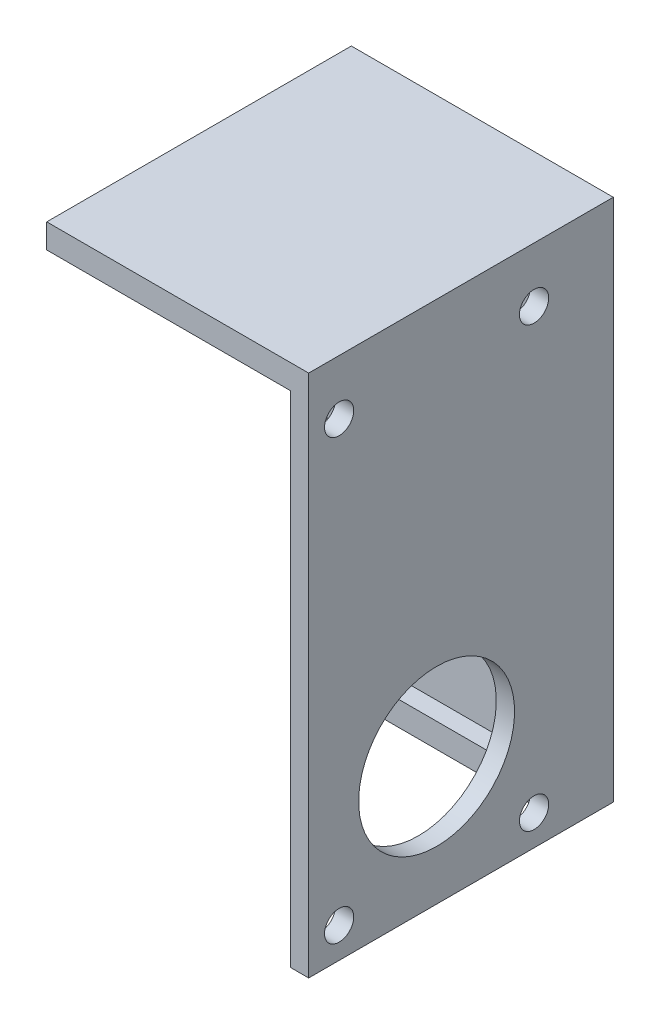
ISO-10303-21;
HEADER;
FILE_DESCRIPTION(('STEP AP214'),'2;1');
FILE_NAME('part.step','',(''),(''),'','','');
FILE_SCHEMA(('AUTOMOTIVE_DESIGN { 1 0 10303 214 1 1 1 1 }'));
ENDSEC;
DATA;
#1=APPLICATION_CONTEXT('core data for automotive mechanical design processes');
#2=APPLICATION_PROTOCOL_DEFINITION('international standard','automotive_design',2000,#1);
#3=PRODUCT_CONTEXT('',#1,'mechanical');
#4=PRODUCT('Part','Part','',(#3));
#5=PRODUCT_RELATED_PRODUCT_CATEGORY('part','',(#4));
#6=PRODUCT_DEFINITION_FORMATION('','',#4);
#7=PRODUCT_DEFINITION_CONTEXT('part definition',#1,'design');
#8=PRODUCT_DEFINITION('design','',#6,#7);
#9=PRODUCT_DEFINITION_SHAPE('','',#8);
#10=(LENGTH_UNIT() NAMED_UNIT(*) SI_UNIT(.MILLI.,.METRE.));
#11=(NAMED_UNIT(*) PLANE_ANGLE_UNIT() SI_UNIT($,.RADIAN.));
#12=(NAMED_UNIT(*) SI_UNIT($,.STERADIAN.) SOLID_ANGLE_UNIT());
#13=UNCERTAINTY_MEASURE_WITH_UNIT(LENGTH_MEASURE(1.E-05),#10,'distance_accuracy_value','');
#14=(GEOMETRIC_REPRESENTATION_CONTEXT(3) GLOBAL_UNCERTAINTY_ASSIGNED_CONTEXT((#13)) GLOBAL_UNIT_ASSIGNED_CONTEXT((#10,
#11,#12)) REPRESENTATION_CONTEXT('',''));
#15=CARTESIAN_POINT('',(0.,0.,0.));
#16=DIRECTION('',(0.,0.,1.));
#17=DIRECTION('',(1.,0.,0.));
#18=AXIS2_PLACEMENT_3D('',#15,#16,#17);
#19=CARTESIAN_POINT('',(10.,0.,25.));
#20=DIRECTION('',(1.,0.,0.));
#21=DIRECTION('',(0.,1.,0.));
#22=AXIS2_PLACEMENT_3D('',#19,#20,#21);
#23=PLANE('',#22);
#24=CARTESIAN_POINT('',(10.,-18.,6.50000000000001));
#25=DIRECTION('',(1.,0.,0.));
#26=DIRECTION('',(0.,1.,0.));
#27=AXIS2_PLACEMENT_3D('',#24,#25,#26);
#28=CIRCLE('',#27,1.2);
#29=CARTESIAN_POINT('',(10.,-16.8,6.50000000000001));
#30=VERTEX_POINT('',#29);
#31=EDGE_CURVE('E193',#30,#30,#28,.F.);
#32=ORIENTED_EDGE('',*,*,#31,.F.);
#33=EDGE_LOOP('',(#32));
#34=FACE_BOUND('',#33,.T.);
#35=CARTESIAN_POINT('',(10.,18.,22.5));
#36=DIRECTION('',(1.,0.,0.));
#37=DIRECTION('',(0.,1.,0.));
#38=AXIS2_PLACEMENT_3D('',#35,#36,#37);
#39=CIRCLE('',#38,1.2);
#40=CARTESIAN_POINT('',(10.,19.2,22.5));
#41=VERTEX_POINT('',#40);
#42=EDGE_CURVE('E189',#41,#41,#39,.F.);
#43=ORIENTED_EDGE('',*,*,#42,.F.);
#44=EDGE_LOOP('',(#43));
#45=FACE_BOUND('',#44,.T.);
#46=CARTESIAN_POINT('',(10.,-18.,22.5));
#47=DIRECTION('',(1.,0.,0.));
#48=DIRECTION('',(0.,1.,0.));
#49=AXIS2_PLACEMENT_3D('',#46,#47,#48);
#50=CIRCLE('',#49,1.2);
#51=CARTESIAN_POINT('',(10.,-16.8,22.5));
#52=VERTEX_POINT('',#51);
#53=EDGE_CURVE('E177',#52,#52,#50,.T.);
#54=ORIENTED_EDGE('',*,*,#53,.T.);
#55=EDGE_LOOP('',(#54));
#56=FACE_BOUND('',#55,.T.);
#57=CARTESIAN_POINT('',(10.,-10.,14.5));
#58=DIRECTION('',(1.,0.,0.));
#59=DIRECTION('',(0.,1.,0.));
#60=AXIS2_PLACEMENT_3D('',#57,#58,#59);
#61=CIRCLE('',#60,6.4);
#62=CARTESIAN_POINT('',(10.,-3.60000000000001,14.5));
#63=VERTEX_POINT('',#62);
#64=EDGE_CURVE('E181',#63,#63,#61,.T.);
#65=ORIENTED_EDGE('',*,*,#64,.T.);
#66=EDGE_LOOP('',(#65));
#67=FACE_BOUND('',#66,.T.);
#68=CARTESIAN_POINT('',(10.,18.,6.50000000000001));
#69=DIRECTION('',(1.,0.,0.));
#70=DIRECTION('',(0.,1.,0.));
#71=AXIS2_PLACEMENT_3D('',#68,#69,#70);
#72=CIRCLE('',#71,1.2);
#73=CARTESIAN_POINT('',(10.,19.2,6.50000000000001));
#74=VERTEX_POINT('',#73);
#75=EDGE_CURVE('E185',#74,#74,#72,.T.);
#76=ORIENTED_EDGE('',*,*,#75,.T.);
#77=EDGE_LOOP('',(#76));
#78=FACE_BOUND('',#77,.T.);
#79=DIRECTION('',(0.,-1.,0.));
#80=VECTOR('',#79,1.);
#81=CARTESIAN_POINT('',(10.,20.5,3.5));
#82=LINE('',#81,#80);
#83=CARTESIAN_POINT('',(10.,20.5,3.5));
#84=VERTEX_POINT('',#83);
#85=CARTESIAN_POINT('',(10.,18.5,3.5));
#86=VERTEX_POINT('',#85);
#87=EDGE_CURVE('E57',#84,#86,#82,.T.);
#88=ORIENTED_EDGE('',*,*,#87,.T.);
#89=DIRECTION('',(0.,0.,-1.));
#90=VECTOR('',#89,1.);
#91=CARTESIAN_POINT('',(10.,18.5,3.5));
#92=LINE('',#91,#90);
#93=CARTESIAN_POINT('',(10.,18.5,2.));
#94=VERTEX_POINT('',#93);
#95=EDGE_CURVE('E355',#86,#94,#92,.T.);
#96=ORIENTED_EDGE('',*,*,#95,.T.);
#97=DIRECTION('',(0.,-1.,0.));
#98=VECTOR('',#97,1.);
#99=CARTESIAN_POINT('',(10.,0.,2.));
#100=LINE('',#99,#98);
#101=CARTESIAN_POINT('',(10.,-18.5,2.));
#102=VERTEX_POINT('',#101);
#103=EDGE_CURVE('E256',#94,#102,#100,.T.);
#104=ORIENTED_EDGE('',*,*,#103,.T.);
#105=DIRECTION('',(0.,0.,-1.));
#106=VECTOR('',#105,1.);
#107=CARTESIAN_POINT('',(10.,-18.5,3.5));
#108=LINE('',#107,#106);
#109=CARTESIAN_POINT('',(10.,-18.5,3.5));
#110=VERTEX_POINT('',#109);
#111=EDGE_CURVE('E65',#110,#102,#108,.T.);
#112=ORIENTED_EDGE('',*,*,#111,.F.);
#113=DIRECTION('',(0.,1.,0.));
#114=VECTOR('',#113,1.);
#115=CARTESIAN_POINT('',(10.,-20.5,3.5));
#116=LINE('',#115,#114);
#117=CARTESIAN_POINT('',(10.,-20.5,3.5));
#118=VERTEX_POINT('',#117);
#119=EDGE_CURVE('E339',#118,#110,#116,.T.);
#120=ORIENTED_EDGE('',*,*,#119,.F.);
#121=DIRECTION('',(0.,0.,-1.));
#122=VECTOR('',#121,1.);
#123=CARTESIAN_POINT('',(10.,-20.5,25.));
#124=LINE('',#123,#122);
#125=CARTESIAN_POINT('',(10.,-20.5,25.));
#126=VERTEX_POINT('',#125);
#127=EDGE_CURVE('E215',#126,#118,#124,.T.);
#128=ORIENTED_EDGE('',*,*,#127,.F.);
#129=DIRECTION('',(0.,-1.,0.));
#130=VECTOR('',#129,1.);
#131=CARTESIAN_POINT('',(10.,0.,25.));
#132=LINE('',#131,#130);
#133=CARTESIAN_POINT('',(10.,20.5,25.));
#134=VERTEX_POINT('',#133);
#135=EDGE_CURVE('E202',#134,#126,#132,.T.);
#136=ORIENTED_EDGE('',*,*,#135,.F.);
#137=DIRECTION('',(0.,0.,-1.));
#138=VECTOR('',#137,1.);
#139=CARTESIAN_POINT('',(10.,20.5,25.));
#140=LINE('',#139,#138);
#141=EDGE_CURVE('E219',#134,#84,#140,.T.);
#142=ORIENTED_EDGE('',*,*,#141,.T.);
#143=EDGE_LOOP('',(#88,#96,#104,#112,#120,#128,#136,#142));
#144=FACE_BOUND('',#143,.T.);
#145=ADVANCED_FACE('F41',(#34,#45,#56,#67,#78,#144),#23,.F.);
#146=CARTESIAN_POINT('',(0.,0.,2.));
#147=DIRECTION('',(0.,0.,1.));
#148=DIRECTION('',(1.,0.,0.));
#149=AXIS2_PLACEMENT_3D('',#146,#147,#148);
#150=PLANE('',#149);
#151=DIRECTION('',(-1.,0.,0.));
#152=VECTOR('',#151,1.);
#153=CARTESIAN_POINT('',(10.,18.5,2.));
#154=LINE('',#153,#152);
#155=CARTESIAN_POINT('',(-10.,18.5,2.));
#156=VERTEX_POINT('',#155);
#157=EDGE_CURVE('E359',#94,#156,#154,.T.);
#158=ORIENTED_EDGE('',*,*,#157,.T.);
#159=DIRECTION('',(0.,-1.,0.));
#160=VECTOR('',#159,1.);
#161=CARTESIAN_POINT('',(-10.,0.,2.));
#162=LINE('',#161,#160);
#163=CARTESIAN_POINT('',(-9.99999999999999,-18.5,2.));
#164=VERTEX_POINT('',#163);
#165=EDGE_CURVE('E50',#156,#164,#162,.T.);
#166=ORIENTED_EDGE('',*,*,#165,.T.);
#167=DIRECTION('',(-1.,0.,0.));
#168=VECTOR('',#167,1.);
#169=CARTESIAN_POINT('',(10.,-18.5,2.));
#170=LINE('',#169,#168);
#171=EDGE_CURVE('E335',#102,#164,#170,.T.);
#172=ORIENTED_EDGE('',*,*,#171,.F.);
#173=ORIENTED_EDGE('',*,*,#103,.F.);
#174=EDGE_LOOP('',(#158,#166,#172,#173));
#175=FACE_BOUND('',#174,.T.);
#176=CARTESIAN_POINT('',(-4.94974746830583,4.94974746830583,2.));
#177=DIRECTION('',(0.,0.,1.));
#178=DIRECTION('',(1.,0.,0.));
#179=AXIS2_PLACEMENT_3D('',#176,#177,#178);
#180=CIRCLE('',#179,1.3);
#181=CARTESIAN_POINT('',(-3.64974746830583,4.94974746830583,2.));
#182=VERTEX_POINT('',#181);
#183=EDGE_CURVE('E223',#182,#182,#180,.T.);
#184=ORIENTED_EDGE('',*,*,#183,.F.);
#185=EDGE_LOOP('',(#184));
#186=FACE_BOUND('',#185,.T.);
#187=CARTESIAN_POINT('',(-7.,0.,2.));
#188=DIRECTION('',(0.,0.,1.));
#189=DIRECTION('',(1.,0.,0.));
#190=AXIS2_PLACEMENT_3D('',#187,#188,#189);
#191=CIRCLE('',#190,1.3);
#192=CARTESIAN_POINT('',(-5.7,0.,2.));
#193=VERTEX_POINT('',#192);
#194=EDGE_CURVE('E227',#193,#193,#191,.T.);
#195=ORIENTED_EDGE('',*,*,#194,.F.);
#196=EDGE_LOOP('',(#195));
#197=FACE_BOUND('',#196,.T.);
#198=CARTESIAN_POINT('',(-4.94974746830583,-4.94974746830583,2.));
#199=DIRECTION('',(0.,0.,1.));
#200=DIRECTION('',(1.,0.,0.));
#201=AXIS2_PLACEMENT_3D('',#198,#199,#200);
#202=CIRCLE('',#201,1.3);
#203=CARTESIAN_POINT('',(-3.64974746830583,-4.94974746830583,2.));
#204=VERTEX_POINT('',#203);
#205=EDGE_CURVE('E232',#204,#204,#202,.T.);
#206=ORIENTED_EDGE('',*,*,#205,.F.);
#207=EDGE_LOOP('',(#206));
#208=FACE_BOUND('',#207,.T.);
#209=CARTESIAN_POINT('',(0.,-7.,2.));
#210=DIRECTION('',(0.,0.,1.));
#211=DIRECTION('',(1.,0.,0.));
#212=AXIS2_PLACEMENT_3D('',#209,#210,#211);
#213=CIRCLE('',#212,1.3);
#214=CARTESIAN_POINT('',(1.3,-7.,2.));
#215=VERTEX_POINT('',#214);
#216=EDGE_CURVE('E236',#215,#215,#213,.T.);
#217=ORIENTED_EDGE('',*,*,#216,.F.);
#218=EDGE_LOOP('',(#217));
#219=FACE_BOUND('',#218,.T.);
#220=CARTESIAN_POINT('',(4.94974746830583,-4.94974746830583,2.));
#221=DIRECTION('',(0.,0.,1.));
#222=DIRECTION('',(1.,0.,0.));
#223=AXIS2_PLACEMENT_3D('',#220,#221,#222);
#224=CIRCLE('',#223,1.3);
#225=CARTESIAN_POINT('',(6.24974746830583,-4.94974746830583,2.));
#226=VERTEX_POINT('',#225);
#227=EDGE_CURVE('E240',#226,#226,#224,.T.);
#228=ORIENTED_EDGE('',*,*,#227,.F.);
#229=EDGE_LOOP('',(#228));
#230=FACE_BOUND('',#229,.T.);
#231=CARTESIAN_POINT('',(7.,0.,2.));
#232=DIRECTION('',(0.,0.,1.));
#233=DIRECTION('',(1.,0.,0.));
#234=AXIS2_PLACEMENT_3D('',#231,#232,#233);
#235=CIRCLE('',#234,1.3);
#236=CARTESIAN_POINT('',(8.3,0.,2.));
#237=VERTEX_POINT('',#236);
#238=EDGE_CURVE('E244',#237,#237,#235,.T.);
#239=ORIENTED_EDGE('',*,*,#238,.F.);
#240=EDGE_LOOP('',(#239));
#241=FACE_BOUND('',#240,.T.);
#242=CARTESIAN_POINT('',(4.94974746830583,4.94974746830583,2.));
#243=DIRECTION('',(0.,0.,1.));
#244=DIRECTION('',(1.,0.,0.));
#245=AXIS2_PLACEMENT_3D('',#242,#243,#244);
#246=CIRCLE('',#245,1.3);
#247=CARTESIAN_POINT('',(6.24974746830583,4.94974746830583,2.));
#248=VERTEX_POINT('',#247);
#249=EDGE_CURVE('E248',#248,#248,#246,.T.);
#250=ORIENTED_EDGE('',*,*,#249,.F.);
#251=EDGE_LOOP('',(#250));
#252=FACE_BOUND('',#251,.T.);
#253=CARTESIAN_POINT('',(0.,7.,2.));
#254=DIRECTION('',(0.,0.,1.));
#255=DIRECTION('',(1.,0.,0.));
#256=AXIS2_PLACEMENT_3D('',#253,#254,#255);
#257=CIRCLE('',#256,1.3);
#258=CARTESIAN_POINT('',(1.3,7.,2.));
#259=VERTEX_POINT('',#258);
#260=EDGE_CURVE('E252',#259,#259,#257,.T.);
#261=ORIENTED_EDGE('',*,*,#260,.F.);
#262=EDGE_LOOP('',(#261));
#263=FACE_BOUND('',#262,.T.);
#264=ADVANCED_FACE('F377',(#175,#186,#197,#208,#219,#230,#241,#252,#263),#150,.T.);
#265=CARTESIAN_POINT('',(11.5,0.,25.));
#266=DIRECTION('',(1.,0.,0.));
#267=DIRECTION('',(0.,1.,0.));
#268=AXIS2_PLACEMENT_3D('',#265,#266,#267);
#269=PLANE('',#268);
#270=CARTESIAN_POINT('',(11.5,18.,22.5));
#271=DIRECTION('',(1.,0.,0.));
#272=DIRECTION('',(0.,1.,0.));
#273=AXIS2_PLACEMENT_3D('',#270,#271,#272);
#274=CIRCLE('',#273,1.2);
#275=CARTESIAN_POINT('',(11.5,19.2,22.5));
#276=VERTEX_POINT('',#275);
#277=EDGE_CURVE('E164',#276,#276,#274,.F.);
#278=ORIENTED_EDGE('',*,*,#277,.T.);
#279=EDGE_LOOP('',(#278));
#280=FACE_BOUND('',#279,.T.);
#281=CARTESIAN_POINT('',(11.5,18.,6.50000000000001));
#282=DIRECTION('',(1.,0.,0.));
#283=DIRECTION('',(0.,1.,0.));
#284=AXIS2_PLACEMENT_3D('',#281,#282,#283);
#285=CIRCLE('',#284,1.2);
#286=CARTESIAN_POINT('',(11.5,19.2,6.50000000000001));
#287=VERTEX_POINT('',#286);
#288=EDGE_CURVE('E155',#287,#287,#285,.T.);
#289=ORIENTED_EDGE('',*,*,#288,.F.);
#290=EDGE_LOOP('',(#289));
#291=FACE_BOUND('',#290,.T.);
#292=CARTESIAN_POINT('',(11.5,-10.,14.5));
#293=DIRECTION('',(1.,0.,0.));
#294=DIRECTION('',(0.,1.,0.));
#295=AXIS2_PLACEMENT_3D('',#292,#293,#294);
#296=CIRCLE('',#295,6.4);
#297=CARTESIAN_POINT('',(11.5,-3.60000000000001,14.5));
#298=VERTEX_POINT('',#297);
#299=EDGE_CURVE('E149',#298,#298,#296,.T.);
#300=ORIENTED_EDGE('',*,*,#299,.F.);
#301=EDGE_LOOP('',(#300));
#302=FACE_BOUND('',#301,.T.);
#303=CARTESIAN_POINT('',(11.5,-18.,22.5));
#304=DIRECTION('',(1.,0.,0.));
#305=DIRECTION('',(0.,1.,0.));
#306=AXIS2_PLACEMENT_3D('',#303,#304,#305);
#307=CIRCLE('',#306,1.2);
#308=CARTESIAN_POINT('',(11.5,-16.8,22.5));
#309=VERTEX_POINT('',#308);
#310=EDGE_CURVE('E170',#309,#309,#307,.T.);
#311=ORIENTED_EDGE('',*,*,#310,.F.);
#312=EDGE_LOOP('',(#311));
#313=FACE_BOUND('',#312,.T.);
#314=DIRECTION('',(0.,-1.,0.));
#315=VECTOR('',#314,1.);
#316=CARTESIAN_POINT('',(11.5,0.,0.));
#317=LINE('',#316,#315);
#318=CARTESIAN_POINT('',(11.5,22.5,0.));
#319=VERTEX_POINT('',#318);
#320=CARTESIAN_POINT('',(11.5,-20.5,0.));
#321=VERTEX_POINT('',#320);
#322=EDGE_CURVE('E197',#319,#321,#317,.T.);
#323=ORIENTED_EDGE('',*,*,#322,.F.);
#324=DIRECTION('',(0.,0.,-1.));
#325=VECTOR('',#324,1.);
#326=CARTESIAN_POINT('',(11.5,22.5,25.));
#327=LINE('',#326,#325);
#328=CARTESIAN_POINT('',(11.5,22.5,25.));
#329=VERTEX_POINT('',#328);
#330=EDGE_CURVE('E150',#329,#319,#327,.T.);
#331=ORIENTED_EDGE('',*,*,#330,.F.);
#332=DIRECTION('',(0.,-1.,0.));
#333=VECTOR('',#332,1.);
#334=CARTESIAN_POINT('',(11.5,0.,25.));
#335=LINE('',#334,#333);
#336=CARTESIAN_POINT('',(11.5,-20.5,25.));
#337=VERTEX_POINT('',#336);
#338=EDGE_CURVE('E198',#329,#337,#335,.T.);
#339=ORIENTED_EDGE('',*,*,#338,.T.);
#340=DIRECTION('',(0.,0.,-1.));
#341=VECTOR('',#340,1.);
#342=CARTESIAN_POINT('',(11.5,-20.5,25.));
#343=LINE('',#342,#341);
#344=EDGE_CURVE('E208',#337,#321,#343,.T.);
#345=ORIENTED_EDGE('',*,*,#344,.T.);
#346=EDGE_LOOP('',(#323,#331,#339,#345));
#347=FACE_BOUND('',#346,.T.);
#348=CARTESIAN_POINT('',(11.5,-18.,6.50000000000001));
#349=DIRECTION('',(1.,0.,0.));
#350=DIRECTION('',(0.,1.,0.));
#351=AXIS2_PLACEMENT_3D('',#348,#349,#350);
#352=CIRCLE('',#351,1.2);
#353=CARTESIAN_POINT('',(11.5,-16.8,6.50000000000001));
#354=VERTEX_POINT('',#353);
#355=EDGE_CURVE('E166',#354,#354,#352,.F.);
#356=ORIENTED_EDGE('',*,*,#355,.T.);
#357=EDGE_LOOP('',(#356));
#358=FACE_BOUND('',#357,.T.);
#359=ADVANCED_FACE('F303',(#280,#291,#302,#313,#347,#358),#269,.T.);
#360=CARTESIAN_POINT('',(-10.,0.,2.));
#361=DIRECTION('',(1.,0.,0.));
#362=DIRECTION('',(0.,1.,0.));
#363=AXIS2_PLACEMENT_3D('',#360,#361,#362);
#364=PLANE('',#363);
#365=ORIENTED_EDGE('',*,*,#165,.F.);
#366=DIRECTION('',(0.,0.,-1.));
#367=VECTOR('',#366,1.);
#368=CARTESIAN_POINT('',(-10.,18.5,3.5));
#369=LINE('',#368,#367);
#370=CARTESIAN_POINT('',(-10.,18.5,3.5));
#371=VERTEX_POINT('',#370);
#372=EDGE_CURVE('E140',#371,#156,#369,.T.);
#373=ORIENTED_EDGE('',*,*,#372,.F.);
#374=DIRECTION('',(0.,1.,0.));
#375=VECTOR('',#374,1.);
#376=CARTESIAN_POINT('',(-9.99999999999999,20.5,3.5));
#377=LINE('',#376,#375);
#378=CARTESIAN_POINT('',(-9.99999999999999,20.5,3.5));
#379=VERTEX_POINT('',#378);
#380=EDGE_CURVE('E127',#371,#379,#377,.T.);
#381=ORIENTED_EDGE('',*,*,#380,.T.);
#382=DIRECTION('',(0.,0.,-1.));
#383=VECTOR('',#382,1.);
#384=CARTESIAN_POINT('',(-10.,20.5,25.));
#385=LINE('',#384,#383);
#386=CARTESIAN_POINT('',(-10.,20.5,25.));
#387=VERTEX_POINT('',#386);
#388=EDGE_CURVE('E138',#387,#379,#385,.T.);
#389=ORIENTED_EDGE('',*,*,#388,.F.);
#390=DIRECTION('',(0.,1.,0.));
#391=VECTOR('',#390,1.);
#392=CARTESIAN_POINT('',(-10.,0.,25.));
#393=LINE('',#392,#391);
#394=CARTESIAN_POINT('',(-10.,22.5,25.));
#395=VERTEX_POINT('',#394);
#396=EDGE_CURVE('E314',#387,#395,#393,.T.);
#397=ORIENTED_EDGE('',*,*,#396,.T.);
#398=DIRECTION('',(0.,0.,-1.));
#399=VECTOR('',#398,1.);
#400=CARTESIAN_POINT('',(-10.,22.5,25.));
#401=LINE('',#400,#399);
#402=CARTESIAN_POINT('',(-10.,22.5,0.));
#403=VERTEX_POINT('',#402);
#404=EDGE_CURVE('E158',#395,#403,#401,.T.);
#405=ORIENTED_EDGE('',*,*,#404,.T.);
#406=DIRECTION('',(0.,-1.,0.));
#407=VECTOR('',#406,1.);
#408=CARTESIAN_POINT('',(-10.,0.,0.));
#409=LINE('',#408,#407);
#410=CARTESIAN_POINT('',(-9.99999999999999,-20.5,0.));
#411=VERTEX_POINT('',#410);
#412=EDGE_CURVE('E292',#403,#411,#409,.T.);
#413=ORIENTED_EDGE('',*,*,#412,.T.);
#414=DIRECTION('',(0.,0.,-1.));
#415=VECTOR('',#414,1.);
#416=CARTESIAN_POINT('',(-9.99999999999999,-20.5,2.));
#417=LINE('',#416,#415);
#418=CARTESIAN_POINT('',(-9.99999999999999,-20.5,3.5));
#419=VERTEX_POINT('',#418);
#420=EDGE_CURVE('E11',#419,#411,#417,.T.);
#421=ORIENTED_EDGE('',*,*,#420,.F.);
#422=DIRECTION('',(0.,-1.,0.));
#423=VECTOR('',#422,1.);
#424=CARTESIAN_POINT('',(-9.99999999999999,-20.5,3.5));
#425=LINE('',#424,#423);
#426=CARTESIAN_POINT('',(-10.,-18.5,3.5));
#427=VERTEX_POINT('',#426);
#428=EDGE_CURVE('E343',#427,#419,#425,.T.);
#429=ORIENTED_EDGE('',*,*,#428,.F.);
#430=DIRECTION('',(0.,0.,-1.));
#431=VECTOR('',#430,1.);
#432=CARTESIAN_POINT('',(-10.,-18.5,3.5));
#433=LINE('',#432,#431);
#434=EDGE_CURVE('E319',#427,#164,#433,.T.);
#435=ORIENTED_EDGE('',*,*,#434,.T.);
#436=EDGE_LOOP('',(#365,#373,#381,#389,#397,#405,#413,#421,#429,#435));
#437=FACE_BOUND('',#436,.T.);
#438=ADVANCED_FACE('F136',(#437),#364,.F.);
#439=CARTESIAN_POINT('',(0.,7.,2.));
#440=DIRECTION('',(0.,0.,-1.));
#441=DIRECTION('',(-1.,0.,0.));
#442=AXIS2_PLACEMENT_3D('',#439,#440,#441);
#443=CYLINDRICAL_SURFACE('',#442,1.3);
#444=ORIENTED_EDGE('',*,*,#260,.T.);
#445=EDGE_LOOP('',(#444));
#446=FACE_BOUND('',#445,.T.);
#447=CARTESIAN_POINT('',(0.,7.,0.));
#448=DIRECTION('',(0.,0.,1.));
#449=DIRECTION('',(1.,0.,0.));
#450=AXIS2_PLACEMENT_3D('',#447,#448,#449);
#451=CIRCLE('',#450,1.3);
#452=CARTESIAN_POINT('',(1.3,7.,0.));
#453=VERTEX_POINT('',#452);
#454=EDGE_CURVE('E288',#453,#453,#451,.T.);
#455=ORIENTED_EDGE('',*,*,#454,.F.);
#456=EDGE_LOOP('',(#455));
#457=FACE_BOUND('',#456,.T.);
#458=ADVANCED_FACE('F411',(#446,#457),#443,.F.);
#459=CARTESIAN_POINT('',(4.94974746830583,4.94974746830583,2.));
#460=DIRECTION('',(0.,0.,-1.));
#461=DIRECTION('',(-1.,0.,0.));
#462=AXIS2_PLACEMENT_3D('',#459,#460,#461);
#463=CYLINDRICAL_SURFACE('',#462,1.3);
#464=ORIENTED_EDGE('',*,*,#249,.T.);
#465=EDGE_LOOP('',(#464));
#466=FACE_BOUND('',#465,.T.);
#467=CARTESIAN_POINT('',(4.94974746830583,4.94974746830583,0.));
#468=DIRECTION('',(0.,0.,1.));
#469=DIRECTION('',(1.,0.,0.));
#470=AXIS2_PLACEMENT_3D('',#467,#468,#469);
#471=CIRCLE('',#470,1.3);
#472=CARTESIAN_POINT('',(6.24974746830583,4.94974746830583,0.));
#473=VERTEX_POINT('',#472);
#474=EDGE_CURVE('E284',#473,#473,#471,.T.);
#475=ORIENTED_EDGE('',*,*,#474,.F.);
#476=EDGE_LOOP('',(#475));
#477=FACE_BOUND('',#476,.T.);
#478=ADVANCED_FACE('F414',(#466,#477),#463,.F.);
#479=CARTESIAN_POINT('',(7.,0.,2.));
#480=DIRECTION('',(0.,0.,-1.));
#481=DIRECTION('',(-1.,0.,0.));
#482=AXIS2_PLACEMENT_3D('',#479,#480,#481);
#483=CYLINDRICAL_SURFACE('',#482,1.3);
#484=ORIENTED_EDGE('',*,*,#238,.T.);
#485=EDGE_LOOP('',(#484));
#486=FACE_BOUND('',#485,.T.);
#487=CARTESIAN_POINT('',(7.,0.,0.));
#488=DIRECTION('',(0.,0.,1.));
#489=DIRECTION('',(1.,0.,0.));
#490=AXIS2_PLACEMENT_3D('',#487,#488,#489);
#491=CIRCLE('',#490,1.3);
#492=CARTESIAN_POINT('',(8.3,0.,0.));
#493=VERTEX_POINT('',#492);
#494=EDGE_CURVE('E280',#493,#493,#491,.T.);
#495=ORIENTED_EDGE('',*,*,#494,.F.);
#496=EDGE_LOOP('',(#495));
#497=FACE_BOUND('',#496,.T.);
#498=ADVANCED_FACE('F418',(#486,#497),#483,.F.);
#499=CARTESIAN_POINT('',(4.94974746830583,-4.94974746830583,2.));
#500=DIRECTION('',(0.,0.,-1.));
#501=DIRECTION('',(-1.,0.,0.));
#502=AXIS2_PLACEMENT_3D('',#499,#500,#501);
#503=CYLINDRICAL_SURFACE('',#502,1.3);
#504=ORIENTED_EDGE('',*,*,#227,.T.);
#505=EDGE_LOOP('',(#504));
#506=FACE_BOUND('',#505,.T.);
#507=CARTESIAN_POINT('',(4.94974746830583,-4.94974746830583,0.));
#508=DIRECTION('',(0.,0.,1.));
#509=DIRECTION('',(1.,0.,0.));
#510=AXIS2_PLACEMENT_3D('',#507,#508,#509);
#511=CIRCLE('',#510,1.3);
#512=CARTESIAN_POINT('',(6.24974746830583,-4.94974746830583,0.));
#513=VERTEX_POINT('',#512);
#514=EDGE_CURVE('E276',#513,#513,#511,.T.);
#515=ORIENTED_EDGE('',*,*,#514,.F.);
#516=EDGE_LOOP('',(#515));
#517=FACE_BOUND('',#516,.T.);
#518=ADVANCED_FACE('F422',(#506,#517),#503,.F.);
#519=CARTESIAN_POINT('',(0.,-7.,2.));
#520=DIRECTION('',(0.,0.,-1.));
#521=DIRECTION('',(-1.,0.,0.));
#522=AXIS2_PLACEMENT_3D('',#519,#520,#521);
#523=CYLINDRICAL_SURFACE('',#522,1.3);
#524=ORIENTED_EDGE('',*,*,#216,.T.);
#525=EDGE_LOOP('',(#524));
#526=FACE_BOUND('',#525,.T.);
#527=CARTESIAN_POINT('',(0.,-7.,0.));
#528=DIRECTION('',(0.,0.,1.));
#529=DIRECTION('',(1.,0.,0.));
#530=AXIS2_PLACEMENT_3D('',#527,#528,#529);
#531=CIRCLE('',#530,1.3);
#532=CARTESIAN_POINT('',(1.3,-7.,0.));
#533=VERTEX_POINT('',#532);
#534=EDGE_CURVE('E272',#533,#533,#531,.T.);
#535=ORIENTED_EDGE('',*,*,#534,.F.);
#536=EDGE_LOOP('',(#535));
#537=FACE_BOUND('',#536,.T.);
#538=ADVANCED_FACE('F426',(#526,#537),#523,.F.);
#539=CARTESIAN_POINT('',(-4.94974746830583,-4.94974746830583,2.));
#540=DIRECTION('',(0.,0.,-1.));
#541=DIRECTION('',(-1.,0.,0.));
#542=AXIS2_PLACEMENT_3D('',#539,#540,#541);
#543=CYLINDRICAL_SURFACE('',#542,1.3);
#544=ORIENTED_EDGE('',*,*,#205,.T.);
#545=EDGE_LOOP('',(#544));
#546=FACE_BOUND('',#545,.T.);
#547=CARTESIAN_POINT('',(-4.94974746830583,-4.94974746830583,0.));
#548=DIRECTION('',(0.,0.,1.));
#549=DIRECTION('',(1.,0.,0.));
#550=AXIS2_PLACEMENT_3D('',#547,#548,#549);
#551=CIRCLE('',#550,1.3);
#552=CARTESIAN_POINT('',(-3.64974746830583,-4.94974746830583,0.));
#553=VERTEX_POINT('',#552);
#554=EDGE_CURVE('E268',#553,#553,#551,.T.);
#555=ORIENTED_EDGE('',*,*,#554,.F.);
#556=EDGE_LOOP('',(#555));
#557=FACE_BOUND('',#556,.T.);
#558=ADVANCED_FACE('F430',(#546,#557),#543,.F.);
#559=CARTESIAN_POINT('',(-7.,0.,2.));
#560=DIRECTION('',(0.,0.,-1.));
#561=DIRECTION('',(-1.,0.,0.));
#562=AXIS2_PLACEMENT_3D('',#559,#560,#561);
#563=CYLINDRICAL_SURFACE('',#562,1.3);
#564=ORIENTED_EDGE('',*,*,#194,.T.);
#565=EDGE_LOOP('',(#564));
#566=FACE_BOUND('',#565,.T.);
#567=CARTESIAN_POINT('',(-7.,0.,0.));
#568=DIRECTION('',(0.,0.,1.));
#569=DIRECTION('',(1.,0.,0.));
#570=AXIS2_PLACEMENT_3D('',#567,#568,#569);
#571=CIRCLE('',#570,1.3);
#572=CARTESIAN_POINT('',(-5.7,0.,0.));
#573=VERTEX_POINT('',#572);
#574=EDGE_CURVE('E264',#573,#573,#571,.T.);
#575=ORIENTED_EDGE('',*,*,#574,.F.);
#576=EDGE_LOOP('',(#575));
#577=FACE_BOUND('',#576,.T.);
#578=ADVANCED_FACE('F433',(#566,#577),#563,.F.);
#579=CARTESIAN_POINT('',(-4.94974746830583,4.94974746830583,2.));
#580=DIRECTION('',(0.,0.,-1.));
#581=DIRECTION('',(-1.,0.,0.));
#582=AXIS2_PLACEMENT_3D('',#579,#580,#581);
#583=CYLINDRICAL_SURFACE('',#582,1.3);
#584=ORIENTED_EDGE('',*,*,#183,.T.);
#585=EDGE_LOOP('',(#584));
#586=FACE_BOUND('',#585,.T.);
#587=CARTESIAN_POINT('',(-4.94974746830583,4.94974746830583,0.));
#588=DIRECTION('',(0.,0.,1.));
#589=DIRECTION('',(1.,0.,0.));
#590=AXIS2_PLACEMENT_3D('',#587,#588,#589);
#591=CIRCLE('',#590,1.3);
#592=CARTESIAN_POINT('',(-3.64974746830583,4.94974746830583,0.));
#593=VERTEX_POINT('',#592);
#594=EDGE_CURVE('E222',#593,#593,#591,.T.);
#595=ORIENTED_EDGE('',*,*,#594,.F.);
#596=EDGE_LOOP('',(#595));
#597=FACE_BOUND('',#596,.T.);
#598=ADVANCED_FACE('F43',(#586,#597),#583,.F.);
#599=CARTESIAN_POINT('',(0.,-20.5,2.));
#600=DIRECTION('',(0.,1.,0.));
#601=DIRECTION('',(0.,0.,1.));
#602=AXIS2_PLACEMENT_3D('',#599,#600,#601);
#603=PLANE('',#602);
#604=DIRECTION('',(1.,0.,0.));
#605=VECTOR('',#604,1.);
#606=CARTESIAN_POINT('',(0.,-20.5,0.));
#607=LINE('',#606,#605);
#608=EDGE_CURVE('E228',#411,#321,#607,.T.);
#609=ORIENTED_EDGE('',*,*,#608,.T.);
#610=ORIENTED_EDGE('',*,*,#344,.F.);
#611=DIRECTION('',(1.,0.,0.));
#612=VECTOR('',#611,1.);
#613=CARTESIAN_POINT('',(0.,-20.5,25.));
#614=LINE('',#613,#612);
#615=EDGE_CURVE('E205',#126,#337,#614,.T.);
#616=ORIENTED_EDGE('',*,*,#615,.F.);
#617=ORIENTED_EDGE('',*,*,#127,.T.);
#618=DIRECTION('',(1.,0.,0.));
#619=VECTOR('',#618,1.);
#620=CARTESIAN_POINT('',(10.,-20.5,3.5));
#621=LINE('',#620,#619);
#622=EDGE_CURVE('E334',#419,#118,#621,.T.);
#623=ORIENTED_EDGE('',*,*,#622,.F.);
#624=ORIENTED_EDGE('',*,*,#420,.T.);
#625=EDGE_LOOP('',(#609,#610,#616,#617,#623,#624));
#626=FACE_BOUND('',#625,.T.);
#627=ADVANCED_FACE('F298',(#626),#603,.F.);
#628=CARTESIAN_POINT('',(0.,0.,0.));
#629=DIRECTION('',(0.,0.,1.));
#630=DIRECTION('',(1.,0.,0.));
#631=AXIS2_PLACEMENT_3D('',#628,#629,#630);
#632=PLANE('',#631);
#633=ORIENTED_EDGE('',*,*,#594,.T.);
#634=EDGE_LOOP('',(#633));
#635=FACE_BOUND('',#634,.T.);
#636=ORIENTED_EDGE('',*,*,#574,.T.);
#637=EDGE_LOOP('',(#636));
#638=FACE_BOUND('',#637,.T.);
#639=ORIENTED_EDGE('',*,*,#554,.T.);
#640=EDGE_LOOP('',(#639));
#641=FACE_BOUND('',#640,.T.);
#642=ORIENTED_EDGE('',*,*,#534,.T.);
#643=EDGE_LOOP('',(#642));
#644=FACE_BOUND('',#643,.T.);
#645=ORIENTED_EDGE('',*,*,#514,.T.);
#646=EDGE_LOOP('',(#645));
#647=FACE_BOUND('',#646,.T.);
#648=ORIENTED_EDGE('',*,*,#494,.T.);
#649=EDGE_LOOP('',(#648));
#650=FACE_BOUND('',#649,.T.);
#651=ORIENTED_EDGE('',*,*,#474,.T.);
#652=EDGE_LOOP('',(#651));
#653=FACE_BOUND('',#652,.T.);
#654=ORIENTED_EDGE('',*,*,#454,.T.);
#655=EDGE_LOOP('',(#654));
#656=FACE_BOUND('',#655,.T.);
#657=ORIENTED_EDGE('',*,*,#412,.F.);
#658=DIRECTION('',(-1.,0.,0.));
#659=VECTOR('',#658,1.);
#660=CARTESIAN_POINT('',(0.,22.5,0.));
#661=LINE('',#660,#659);
#662=EDGE_CURVE('E309',#319,#403,#661,.T.);
#663=ORIENTED_EDGE('',*,*,#662,.F.);
#664=ORIENTED_EDGE('',*,*,#322,.T.);
#665=ORIENTED_EDGE('',*,*,#608,.F.);
#666=EDGE_LOOP('',(#657,#663,#664,#665));
#667=FACE_BOUND('',#666,.T.);
#668=ADVANCED_FACE('F307',(#635,#638,#641,#644,#647,#650,#653,#656,#667),#632,.F.);
#669=CARTESIAN_POINT('',(0.,0.,25.));
#670=DIRECTION('',(0.,0.,1.));
#671=DIRECTION('',(1.,0.,0.));
#672=AXIS2_PLACEMENT_3D('',#669,#670,#671);
#673=PLANE('',#672);
#674=ORIENTED_EDGE('',*,*,#338,.F.);
#675=DIRECTION('',(-1.,0.,0.));
#676=VECTOR('',#675,1.);
#677=CARTESIAN_POINT('',(0.,22.5,25.));
#678=LINE('',#677,#676);
#679=EDGE_CURVE('E322',#329,#395,#678,.T.);
#680=ORIENTED_EDGE('',*,*,#679,.T.);
#681=ORIENTED_EDGE('',*,*,#396,.F.);
#682=DIRECTION('',(1.,0.,0.));
#683=VECTOR('',#682,1.);
#684=CARTESIAN_POINT('',(0.,20.5,25.));
#685=LINE('',#684,#683);
#686=EDGE_CURVE('E146',#387,#134,#685,.T.);
#687=ORIENTED_EDGE('',*,*,#686,.T.);
#688=ORIENTED_EDGE('',*,*,#135,.T.);
#689=ORIENTED_EDGE('',*,*,#615,.T.);
#690=EDGE_LOOP('',(#674,#680,#681,#687,#688,#689));
#691=FACE_BOUND('',#690,.T.);
#692=ADVANCED_FACE('F368',(#691),#673,.T.);
#693=CARTESIAN_POINT('',(-10.,-18.,22.5));
#694=DIRECTION('',(1.,0.,0.));
#695=DIRECTION('',(0.,1.,0.));
#696=AXIS2_PLACEMENT_3D('',#693,#694,#695);
#697=CYLINDRICAL_SURFACE('',#696,1.2);
#698=ORIENTED_EDGE('',*,*,#310,.T.);
#699=EDGE_LOOP('',(#698));
#700=FACE_BOUND('',#699,.T.);
#701=ORIENTED_EDGE('',*,*,#53,.F.);
#702=EDGE_LOOP('',(#701));
#703=FACE_BOUND('',#702,.T.);
#704=ADVANCED_FACE('F499',(#700,#703),#697,.F.);
#705=CARTESIAN_POINT('',(-10.,-10.,14.5));
#706=DIRECTION('',(1.,0.,0.));
#707=DIRECTION('',(0.,1.,0.));
#708=AXIS2_PLACEMENT_3D('',#705,#706,#707);
#709=CYLINDRICAL_SURFACE('',#708,6.4);
#710=ORIENTED_EDGE('',*,*,#299,.T.);
#711=EDGE_LOOP('',(#710));
#712=FACE_BOUND('',#711,.T.);
#713=ORIENTED_EDGE('',*,*,#64,.F.);
#714=EDGE_LOOP('',(#713));
#715=FACE_BOUND('',#714,.T.);
#716=ADVANCED_FACE('F504',(#712,#715),#709,.F.);
#717=CARTESIAN_POINT('',(-10.,18.,6.50000000000001));
#718=DIRECTION('',(1.,0.,0.));
#719=DIRECTION('',(0.,1.,0.));
#720=AXIS2_PLACEMENT_3D('',#717,#718,#719);
#721=CYLINDRICAL_SURFACE('',#720,1.2);
#722=ORIENTED_EDGE('',*,*,#288,.T.);
#723=EDGE_LOOP('',(#722));
#724=FACE_BOUND('',#723,.T.);
#725=ORIENTED_EDGE('',*,*,#75,.F.);
#726=EDGE_LOOP('',(#725));
#727=FACE_BOUND('',#726,.T.);
#728=ADVANCED_FACE('F511',(#724,#727),#721,.F.);
#729=CARTESIAN_POINT('',(-10.,18.,22.5));
#730=DIRECTION('',(1.,0.,0.));
#731=DIRECTION('',(0.,1.,0.));
#732=AXIS2_PLACEMENT_3D('',#729,#730,#731);
#733=CYLINDRICAL_SURFACE('',#732,1.2);
#734=ORIENTED_EDGE('',*,*,#277,.F.);
#735=EDGE_LOOP('',(#734));
#736=FACE_BOUND('',#735,.T.);
#737=ORIENTED_EDGE('',*,*,#42,.T.);
#738=EDGE_LOOP('',(#737));
#739=FACE_BOUND('',#738,.T.);
#740=ADVANCED_FACE('F519',(#736,#739),#733,.F.);
#741=CARTESIAN_POINT('',(-10.,-18.,6.50000000000001));
#742=DIRECTION('',(1.,0.,0.));
#743=DIRECTION('',(0.,1.,0.));
#744=AXIS2_PLACEMENT_3D('',#741,#742,#743);
#745=CYLINDRICAL_SURFACE('',#744,1.2);
#746=ORIENTED_EDGE('',*,*,#355,.F.);
#747=EDGE_LOOP('',(#746));
#748=FACE_BOUND('',#747,.T.);
#749=ORIENTED_EDGE('',*,*,#31,.T.);
#750=EDGE_LOOP('',(#749));
#751=FACE_BOUND('',#750,.T.);
#752=ADVANCED_FACE('F527',(#748,#751),#745,.F.);
#753=CARTESIAN_POINT('',(0.,20.5,25.));
#754=DIRECTION('',(0.,1.,0.));
#755=DIRECTION('',(0.,0.,1.));
#756=AXIS2_PLACEMENT_3D('',#753,#754,#755);
#757=PLANE('',#756);
#758=ORIENTED_EDGE('',*,*,#388,.T.);
#759=DIRECTION('',(1.,0.,0.));
#760=VECTOR('',#759,1.);
#761=CARTESIAN_POINT('',(10.,20.5,3.5));
#762=LINE('',#761,#760);
#763=EDGE_CURVE('E124',#379,#84,#762,.T.);
#764=ORIENTED_EDGE('',*,*,#763,.T.);
#765=ORIENTED_EDGE('',*,*,#141,.F.);
#766=ORIENTED_EDGE('',*,*,#686,.F.);
#767=EDGE_LOOP('',(#758,#764,#765,#766));
#768=FACE_BOUND('',#767,.T.);
#769=ADVANCED_FACE('F144',(#768),#757,.F.);
#770=CARTESIAN_POINT('',(0.,22.5,25.));
#771=DIRECTION('',(0.,-1.,0.));
#772=DIRECTION('',(0.,0.,-1.));
#773=AXIS2_PLACEMENT_3D('',#770,#771,#772);
#774=PLANE('',#773);
#775=ORIENTED_EDGE('',*,*,#662,.T.);
#776=ORIENTED_EDGE('',*,*,#404,.F.);
#777=ORIENTED_EDGE('',*,*,#679,.F.);
#778=ORIENTED_EDGE('',*,*,#330,.T.);
#779=EDGE_LOOP('',(#775,#776,#777,#778));
#780=FACE_BOUND('',#779,.T.);
#781=ADVANCED_FACE('F542',(#780),#774,.F.);
#782=CARTESIAN_POINT('',(10.,-18.5,3.5));
#783=DIRECTION('',(0.,-1.,0.));
#784=DIRECTION('',(0.,0.,-1.));
#785=AXIS2_PLACEMENT_3D('',#782,#783,#784);
#786=PLANE('',#785);
#787=ORIENTED_EDGE('',*,*,#171,.T.);
#788=ORIENTED_EDGE('',*,*,#434,.F.);
#789=DIRECTION('',(-1.,0.,0.));
#790=VECTOR('',#789,1.);
#791=CARTESIAN_POINT('',(10.,-18.5,3.5));
#792=LINE('',#791,#790);
#793=EDGE_CURVE('E347',#110,#427,#792,.T.);
#794=ORIENTED_EDGE('',*,*,#793,.F.);
#795=ORIENTED_EDGE('',*,*,#111,.T.);
#796=EDGE_LOOP('',(#787,#788,#794,#795));
#797=FACE_BOUND('',#796,.T.);
#798=ADVANCED_FACE('F374',(#797),#786,.F.);
#799=CARTESIAN_POINT('',(0.,0.,3.5));
#800=DIRECTION('',(0.,0.,1.));
#801=DIRECTION('',(1.,0.,0.));
#802=AXIS2_PLACEMENT_3D('',#799,#800,#801);
#803=PLANE('',#802);
#804=ORIENTED_EDGE('',*,*,#119,.T.);
#805=ORIENTED_EDGE('',*,*,#793,.T.);
#806=ORIENTED_EDGE('',*,*,#428,.T.);
#807=ORIENTED_EDGE('',*,*,#622,.T.);
#808=EDGE_LOOP('',(#804,#805,#806,#807));
#809=FACE_BOUND('',#808,.T.);
#810=ADVANCED_FACE('F370',(#809),#803,.T.);
#811=CARTESIAN_POINT('',(10.,18.5,3.5));
#812=DIRECTION('',(0.,-1.,0.));
#813=DIRECTION('',(0.,0.,-1.));
#814=AXIS2_PLACEMENT_3D('',#811,#812,#813);
#815=PLANE('',#814);
#816=ORIENTED_EDGE('',*,*,#157,.F.);
#817=ORIENTED_EDGE('',*,*,#95,.F.);
#818=DIRECTION('',(-1.,0.,0.));
#819=VECTOR('',#818,1.);
#820=CARTESIAN_POINT('',(10.,18.5,3.5));
#821=LINE('',#820,#819);
#822=EDGE_CURVE('E142',#86,#371,#821,.T.);
#823=ORIENTED_EDGE('',*,*,#822,.T.);
#824=ORIENTED_EDGE('',*,*,#372,.T.);
#825=EDGE_LOOP('',(#816,#817,#823,#824));
#826=FACE_BOUND('',#825,.T.);
#827=ADVANCED_FACE('F380',(#826),#815,.T.);
#828=CARTESIAN_POINT('',(0.,0.,3.5));
#829=DIRECTION('',(0.,0.,1.));
#830=DIRECTION('',(1.,0.,0.));
#831=AXIS2_PLACEMENT_3D('',#828,#829,#830);
#832=PLANE('',#831);
#833=ORIENTED_EDGE('',*,*,#87,.F.);
#834=ORIENTED_EDGE('',*,*,#763,.F.);
#835=ORIENTED_EDGE('',*,*,#380,.F.);
#836=ORIENTED_EDGE('',*,*,#822,.F.);
#837=EDGE_LOOP('',(#833,#834,#835,#836));
#838=FACE_BOUND('',#837,.T.);
#839=ADVANCED_FACE('F126',(#838),#832,.T.);
#840=CLOSED_SHELL('',(#145,#264,#359,#438,#458,#478,#498,#518,#538,#558,#578,#598,#627,#668,
#692,#704,#716,#728,#740,#752,#769,#781,#798,#810,#827,#839));
#841=MANIFOLD_SOLID_BREP('B2',#840);
#842=ADVANCED_BREP_SHAPE_REPRESENTATION('',(#18,#841),#14);
#843=SHAPE_DEFINITION_REPRESENTATION(#9,#842);
ENDSEC;
END-ISO-10303-21;
